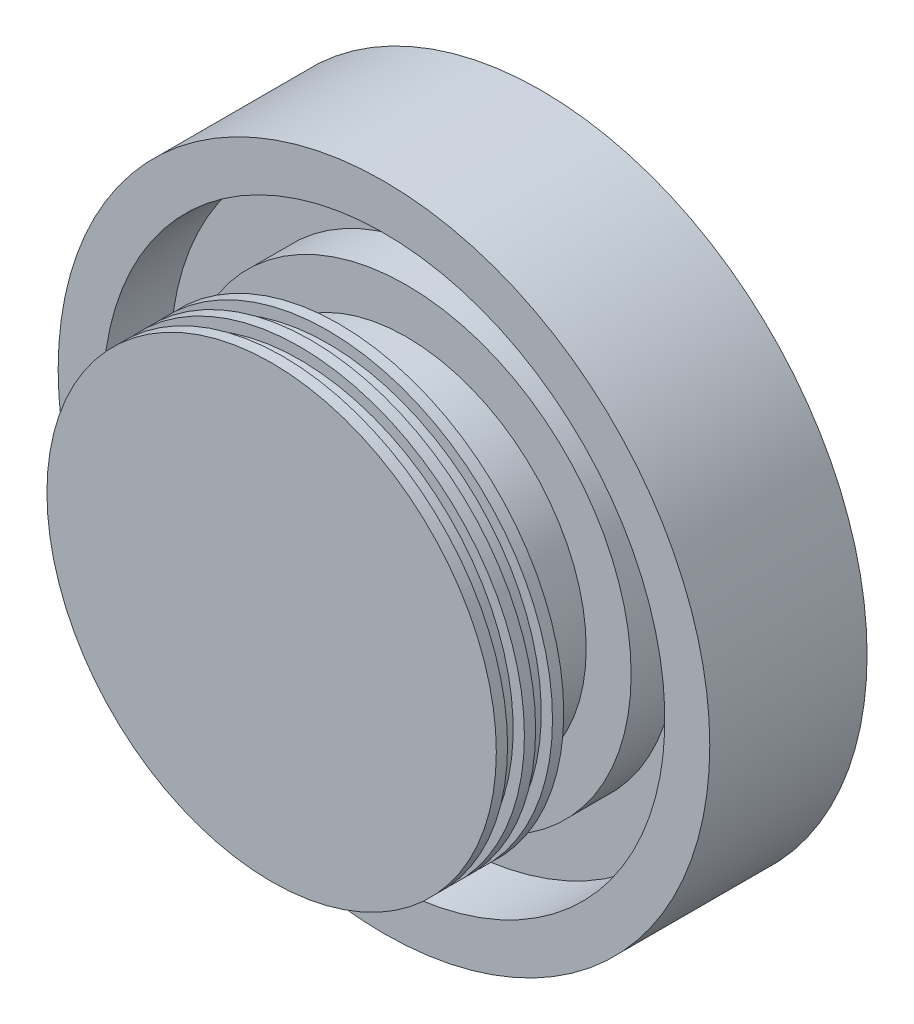
ISO-10303-21;
HEADER;
FILE_DESCRIPTION(('STEP AP214'),'2;1');
FILE_NAME('part.step','',(''),(''),'','','');
FILE_SCHEMA(('AUTOMOTIVE_DESIGN { 1 0 10303 214 1 1 1 1 }'));
ENDSEC;
DATA;
#1=APPLICATION_CONTEXT('core data for automotive mechanical design processes');
#2=APPLICATION_PROTOCOL_DEFINITION('international standard','automotive_design',2000,#1);
#3=PRODUCT_CONTEXT('',#1,'mechanical');
#4=PRODUCT('Part','Part','',(#3));
#5=PRODUCT_RELATED_PRODUCT_CATEGORY('part','',(#4));
#6=PRODUCT_DEFINITION_FORMATION('','',#4);
#7=PRODUCT_DEFINITION_CONTEXT('part definition',#1,'design');
#8=PRODUCT_DEFINITION('design','',#6,#7);
#9=PRODUCT_DEFINITION_SHAPE('','',#8);
#10=(LENGTH_UNIT() NAMED_UNIT(*) SI_UNIT(.MILLI.,.METRE.));
#11=(NAMED_UNIT(*) PLANE_ANGLE_UNIT() SI_UNIT($,.RADIAN.));
#12=(NAMED_UNIT(*) SI_UNIT($,.STERADIAN.) SOLID_ANGLE_UNIT());
#13=UNCERTAINTY_MEASURE_WITH_UNIT(LENGTH_MEASURE(1.E-05),#10,'distance_accuracy_value','');
#14=(GEOMETRIC_REPRESENTATION_CONTEXT(3) GLOBAL_UNCERTAINTY_ASSIGNED_CONTEXT((#13)) GLOBAL_UNIT_ASSIGNED_CONTEXT((#10,
#11,#12)) REPRESENTATION_CONTEXT('',''));
#15=CARTESIAN_POINT('',(0.,0.,0.));
#16=DIRECTION('',(0.,0.,1.));
#17=DIRECTION('',(1.,0.,0.));
#18=AXIS2_PLACEMENT_3D('',#15,#16,#17);
#19=CARTESIAN_POINT('',(0.,0.,-76.2));
#20=DIRECTION('',(0.,0.,-1.));
#21=DIRECTION('',(-1.,0.,0.));
#22=AXIS2_PLACEMENT_3D('',#19,#20,#21);
#23=PLANE('',#22);
#24=CARTESIAN_POINT('',(0.,0.,-76.2));
#25=DIRECTION('',(0.,0.,-1.));
#26=DIRECTION('',(-1.,0.,0.));
#27=AXIS2_PLACEMENT_3D('',#24,#25,#26);
#28=CIRCLE('',#27,92.075);
#29=CARTESIAN_POINT('',(-92.075,0.,-76.2));
#30=VERTEX_POINT('',#29);
#31=EDGE_CURVE('E104',#30,#30,#28,.T.);
#32=ORIENTED_EDGE('',*,*,#31,.T.);
#33=EDGE_LOOP('',(#32));
#34=FACE_BOUND('',#33,.T.);
#35=CARTESIAN_POINT('',(0.,0.,-76.2));
#36=DIRECTION('',(0.,0.,-1.));
#37=DIRECTION('',(-1.,0.,0.));
#38=AXIS2_PLACEMENT_3D('',#35,#36,#37);
#39=CIRCLE('',#38,12.7);
#40=CARTESIAN_POINT('',(-12.7,0.,-76.2));
#41=VERTEX_POINT('',#40);
#42=EDGE_CURVE('E10',#41,#41,#39,.T.);
#43=ORIENTED_EDGE('',*,*,#42,.F.);
#44=EDGE_LOOP('',(#43));
#45=FACE_BOUND('',#44,.T.);
#46=ADVANCED_FACE('F34',(#34,#45),#23,.T.);
#47=CARTESIAN_POINT('',(0.,0.,-44.45));
#48=DIRECTION('',(0.,0.,-1.));
#49=DIRECTION('',(-1.,0.,0.));
#50=AXIS2_PLACEMENT_3D('',#47,#48,#49);
#51=CYLINDRICAL_SURFACE('',#50,12.7);
#52=CARTESIAN_POINT('',(0.,0.,-63.5));
#53=DIRECTION('',(0.,0.,-1.));
#54=DIRECTION('',(-1.,0.,0.));
#55=AXIS2_PLACEMENT_3D('',#52,#53,#54);
#56=CIRCLE('',#55,12.7);
#57=CARTESIAN_POINT('',(-12.7,0.,-63.5));
#58=VERTEX_POINT('',#57);
#59=EDGE_CURVE('E40',#58,#58,#56,.T.);
#60=ORIENTED_EDGE('',*,*,#59,.F.);
#61=EDGE_LOOP('',(#60));
#62=FACE_BOUND('',#61,.T.);
#63=ORIENTED_EDGE('',*,*,#42,.T.);
#64=EDGE_LOOP('',(#63));
#65=FACE_BOUND('',#64,.T.);
#66=ADVANCED_FACE('F223',(#62,#65),#51,.F.);
#67=CARTESIAN_POINT('',(0.,0.,-63.5));
#68=DIRECTION('',(0.,0.,-1.));
#69=DIRECTION('',(-1.,0.,0.));
#70=AXIS2_PLACEMENT_3D('',#67,#68,#69);
#71=PLANE('',#70);
#72=CARTESIAN_POINT('',(0.,0.,-63.5));
#73=DIRECTION('',(0.,0.,-1.));
#74=DIRECTION('',(-1.,0.,0.));
#75=AXIS2_PLACEMENT_3D('',#72,#73,#74);
#76=CIRCLE('',#75,38.1);
#77=CARTESIAN_POINT('',(-38.1,0.,-63.5));
#78=VERTEX_POINT('',#77);
#79=EDGE_CURVE('E44',#78,#78,#76,.T.);
#80=ORIENTED_EDGE('',*,*,#79,.F.);
#81=EDGE_LOOP('',(#80));
#82=FACE_BOUND('',#81,.T.);
#83=ORIENTED_EDGE('',*,*,#59,.T.);
#84=EDGE_LOOP('',(#83));
#85=FACE_BOUND('',#84,.T.);
#86=ADVANCED_FACE('F227',(#82,#85),#71,.F.);
#87=CARTESIAN_POINT('',(0.,0.,-44.45));
#88=DIRECTION('',(0.,0.,-1.));
#89=DIRECTION('',(-1.,0.,0.));
#90=AXIS2_PLACEMENT_3D('',#87,#88,#89);
#91=CYLINDRICAL_SURFACE('',#90,38.1);
#92=CARTESIAN_POINT('',(0.,0.,-44.45));
#93=DIRECTION('',(0.,0.,-1.));
#94=DIRECTION('',(-1.,0.,0.));
#95=AXIS2_PLACEMENT_3D('',#92,#93,#94);
#96=CIRCLE('',#95,38.1);
#97=CARTESIAN_POINT('',(-38.1,0.,-44.45));
#98=VERTEX_POINT('',#97);
#99=EDGE_CURVE('E48',#98,#98,#96,.T.);
#100=ORIENTED_EDGE('',*,*,#99,.F.);
#101=EDGE_LOOP('',(#100));
#102=FACE_BOUND('',#101,.T.);
#103=ORIENTED_EDGE('',*,*,#79,.T.);
#104=EDGE_LOOP('',(#103));
#105=FACE_BOUND('',#104,.T.);
#106=ADVANCED_FACE('F219',(#102,#105),#91,.F.);
#107=CARTESIAN_POINT('',(0.,0.,-44.45));
#108=DIRECTION('',(0.,0.,1.));
#109=DIRECTION('',(1.,0.,0.));
#110=AXIS2_PLACEMENT_3D('',#107,#108,#109);
#111=PLANE('',#110);
#112=ORIENTED_EDGE('',*,*,#99,.T.);
#113=EDGE_LOOP('',(#112));
#114=FACE_BOUND('',#113,.T.);
#115=ADVANCED_FACE('F214',(#114),#111,.F.);
#116=CARTESIAN_POINT('',(0.,0.,0.));
#117=DIRECTION('',(0.,0.,-1.));
#118=DIRECTION('',(-1.,0.,0.));
#119=AXIS2_PLACEMENT_3D('',#116,#117,#118);
#120=PLANE('',#119);
#121=CARTESIAN_POINT('',(0.,0.,0.));
#122=DIRECTION('',(0.,0.,-1.));
#123=DIRECTION('',(-1.,0.,0.));
#124=AXIS2_PLACEMENT_3D('',#121,#122,#123);
#125=CIRCLE('',#124,63.5);
#126=CARTESIAN_POINT('',(-63.5,0.,0.));
#127=VERTEX_POINT('',#126);
#128=EDGE_CURVE('E53',#127,#127,#125,.T.);
#129=ORIENTED_EDGE('',*,*,#128,.F.);
#130=EDGE_LOOP('',(#129));
#131=FACE_BOUND('',#130,.T.);
#132=ADVANCED_FACE('F209',(#131),#120,.F.);
#133=CARTESIAN_POINT('',(0.,0.,-44.45));
#134=DIRECTION('',(0.,0.,-1.));
#135=DIRECTION('',(-1.,0.,0.));
#136=AXIS2_PLACEMENT_3D('',#133,#134,#135);
#137=CYLINDRICAL_SURFACE('',#136,63.5);
#138=CARTESIAN_POINT('',(0.,0.,-3.175));
#139=DIRECTION('',(0.,0.,-1.));
#140=DIRECTION('',(-1.,0.,0.));
#141=AXIS2_PLACEMENT_3D('',#138,#139,#140);
#142=CIRCLE('',#141,63.5);
#143=CARTESIAN_POINT('',(-63.5,0.,-3.17500000000001));
#144=VERTEX_POINT('',#143);
#145=EDGE_CURVE('E56',#144,#144,#142,.T.);
#146=ORIENTED_EDGE('',*,*,#145,.F.);
#147=EDGE_LOOP('',(#146));
#148=FACE_BOUND('',#147,.T.);
#149=ORIENTED_EDGE('',*,*,#128,.T.);
#150=EDGE_LOOP('',(#149));
#151=FACE_BOUND('',#150,.T.);
#152=ADVANCED_FACE('F203',(#148,#151),#137,.T.);
#153=CARTESIAN_POINT('',(0.,0.,-3.17500000000001));
#154=DIRECTION('',(0.,0.,1.));
#155=DIRECTION('',(1.,0.,0.));
#156=AXIS2_PLACEMENT_3D('',#153,#154,#155);
#157=PLANE('',#156);
#158=CARTESIAN_POINT('',(0.,0.,-3.175));
#159=DIRECTION('',(0.,0.,-1.));
#160=DIRECTION('',(-1.,0.,0.));
#161=AXIS2_PLACEMENT_3D('',#158,#159,#160);
#162=CIRCLE('',#161,60.325);
#163=CARTESIAN_POINT('',(-60.325,0.,-3.17500000000001));
#164=VERTEX_POINT('',#163);
#165=EDGE_CURVE('E59',#164,#164,#162,.T.);
#166=ORIENTED_EDGE('',*,*,#165,.F.);
#167=EDGE_LOOP('',(#166));
#168=FACE_BOUND('',#167,.T.);
#169=ORIENTED_EDGE('',*,*,#145,.T.);
#170=EDGE_LOOP('',(#169));
#171=FACE_BOUND('',#170,.T.);
#172=ADVANCED_FACE('F197',(#168,#171),#157,.F.);
#173=CARTESIAN_POINT('',(0.,0.,-44.45));
#174=DIRECTION('',(0.,0.,-1.));
#175=DIRECTION('',(-1.,0.,0.));
#176=AXIS2_PLACEMENT_3D('',#173,#174,#175);
#177=CYLINDRICAL_SURFACE('',#176,60.325);
#178=CARTESIAN_POINT('',(0.,0.,-7.9375));
#179=DIRECTION('',(0.,0.,-1.));
#180=DIRECTION('',(-1.,0.,0.));
#181=AXIS2_PLACEMENT_3D('',#178,#179,#180);
#182=CIRCLE('',#181,60.325);
#183=CARTESIAN_POINT('',(-60.325,0.,-7.93750000000001));
#184=VERTEX_POINT('',#183);
#185=EDGE_CURVE('E62',#184,#184,#182,.T.);
#186=ORIENTED_EDGE('',*,*,#185,.F.);
#187=EDGE_LOOP('',(#186));
#188=FACE_BOUND('',#187,.T.);
#189=ORIENTED_EDGE('',*,*,#165,.T.);
#190=EDGE_LOOP('',(#189));
#191=FACE_BOUND('',#190,.T.);
#192=ADVANCED_FACE('F191',(#188,#191),#177,.T.);
#193=CARTESIAN_POINT('',(0.,0.,-7.9375));
#194=DIRECTION('',(0.,0.,-1.));
#195=DIRECTION('',(-1.,0.,0.));
#196=AXIS2_PLACEMENT_3D('',#193,#194,#195);
#197=PLANE('',#196);
#198=CARTESIAN_POINT('',(0.,0.,-7.93750000000001));
#199=DIRECTION('',(0.,0.,-1.));
#200=DIRECTION('',(-1.,0.,0.));
#201=AXIS2_PLACEMENT_3D('',#198,#199,#200);
#202=CIRCLE('',#201,63.5);
#203=CARTESIAN_POINT('',(-63.5,0.,-7.93750000000001));
#204=VERTEX_POINT('',#203);
#205=EDGE_CURVE('E65',#204,#204,#202,.T.);
#206=ORIENTED_EDGE('',*,*,#205,.F.);
#207=EDGE_LOOP('',(#206));
#208=FACE_BOUND('',#207,.T.);
#209=ORIENTED_EDGE('',*,*,#185,.T.);
#210=EDGE_LOOP('',(#209));
#211=FACE_BOUND('',#210,.T.);
#212=ADVANCED_FACE('F185',(#208,#211),#197,.F.);
#213=CARTESIAN_POINT('',(0.,0.,-44.45));
#214=DIRECTION('',(0.,0.,-1.));
#215=DIRECTION('',(-1.,0.,0.));
#216=AXIS2_PLACEMENT_3D('',#213,#214,#215);
#217=CYLINDRICAL_SURFACE('',#216,63.5);
#218=CARTESIAN_POINT('',(0.,0.,-11.1125));
#219=DIRECTION('',(0.,0.,-1.));
#220=DIRECTION('',(-1.,0.,0.));
#221=AXIS2_PLACEMENT_3D('',#218,#219,#220);
#222=CIRCLE('',#221,63.5);
#223=CARTESIAN_POINT('',(-63.5,0.,-11.1125));
#224=VERTEX_POINT('',#223);
#225=EDGE_CURVE('E68',#224,#224,#222,.T.);
#226=ORIENTED_EDGE('',*,*,#225,.F.);
#227=EDGE_LOOP('',(#226));
#228=FACE_BOUND('',#227,.T.);
#229=ORIENTED_EDGE('',*,*,#205,.T.);
#230=EDGE_LOOP('',(#229));
#231=FACE_BOUND('',#230,.T.);
#232=ADVANCED_FACE('F179',(#228,#231),#217,.T.);
#233=CARTESIAN_POINT('',(0.,0.,-11.1125));
#234=DIRECTION('',(0.,0.,1.));
#235=DIRECTION('',(1.,0.,0.));
#236=AXIS2_PLACEMENT_3D('',#233,#234,#235);
#237=PLANE('',#236);
#238=CARTESIAN_POINT('',(0.,0.,-11.1125));
#239=DIRECTION('',(0.,0.,-1.));
#240=DIRECTION('',(-1.,0.,0.));
#241=AXIS2_PLACEMENT_3D('',#238,#239,#240);
#242=CIRCLE('',#241,60.325);
#243=CARTESIAN_POINT('',(-60.325,0.,-11.1125));
#244=VERTEX_POINT('',#243);
#245=EDGE_CURVE('E71',#244,#244,#242,.T.);
#246=ORIENTED_EDGE('',*,*,#245,.F.);
#247=EDGE_LOOP('',(#246));
#248=FACE_BOUND('',#247,.T.);
#249=ORIENTED_EDGE('',*,*,#225,.T.);
#250=EDGE_LOOP('',(#249));
#251=FACE_BOUND('',#250,.T.);
#252=ADVANCED_FACE('F173',(#248,#251),#237,.F.);
#253=CARTESIAN_POINT('',(0.,0.,-44.45));
#254=DIRECTION('',(0.,0.,-1.));
#255=DIRECTION('',(-1.,0.,0.));
#256=AXIS2_PLACEMENT_3D('',#253,#254,#255);
#257=CYLINDRICAL_SURFACE('',#256,60.325);
#258=CARTESIAN_POINT('',(0.,0.,-15.875));
#259=DIRECTION('',(0.,0.,-1.));
#260=DIRECTION('',(-1.,0.,0.));
#261=AXIS2_PLACEMENT_3D('',#258,#259,#260);
#262=CIRCLE('',#261,60.325);
#263=CARTESIAN_POINT('',(-60.325,0.,-15.875));
#264=VERTEX_POINT('',#263);
#265=EDGE_CURVE('E74',#264,#264,#262,.T.);
#266=ORIENTED_EDGE('',*,*,#265,.F.);
#267=EDGE_LOOP('',(#266));
#268=FACE_BOUND('',#267,.T.);
#269=ORIENTED_EDGE('',*,*,#245,.T.);
#270=EDGE_LOOP('',(#269));
#271=FACE_BOUND('',#270,.T.);
#272=ADVANCED_FACE('F167',(#268,#271),#257,.T.);
#273=CARTESIAN_POINT('',(0.,0.,-15.875));
#274=DIRECTION('',(0.,0.,-1.));
#275=DIRECTION('',(-1.,0.,0.));
#276=AXIS2_PLACEMENT_3D('',#273,#274,#275);
#277=PLANE('',#276);
#278=CARTESIAN_POINT('',(0.,0.,-15.875));
#279=DIRECTION('',(0.,0.,-1.));
#280=DIRECTION('',(-1.,0.,0.));
#281=AXIS2_PLACEMENT_3D('',#278,#279,#280);
#282=CIRCLE('',#281,63.5);
#283=CARTESIAN_POINT('',(-63.5,0.,-15.875));
#284=VERTEX_POINT('',#283);
#285=EDGE_CURVE('E77',#284,#284,#282,.T.);
#286=ORIENTED_EDGE('',*,*,#285,.F.);
#287=EDGE_LOOP('',(#286));
#288=FACE_BOUND('',#287,.T.);
#289=ORIENTED_EDGE('',*,*,#265,.T.);
#290=EDGE_LOOP('',(#289));
#291=FACE_BOUND('',#290,.T.);
#292=ADVANCED_FACE('F161',(#288,#291),#277,.F.);
#293=CARTESIAN_POINT('',(0.,0.,-44.45));
#294=DIRECTION('',(0.,0.,-1.));
#295=DIRECTION('',(-1.,0.,0.));
#296=AXIS2_PLACEMENT_3D('',#293,#294,#295);
#297=CYLINDRICAL_SURFACE('',#296,63.5);
#298=CARTESIAN_POINT('',(0.,0.,-19.05));
#299=DIRECTION('',(0.,0.,-1.));
#300=DIRECTION('',(-1.,0.,0.));
#301=AXIS2_PLACEMENT_3D('',#298,#299,#300);
#302=CIRCLE('',#301,63.5);
#303=CARTESIAN_POINT('',(-63.5,0.,-19.05));
#304=VERTEX_POINT('',#303);
#305=EDGE_CURVE('E80',#304,#304,#302,.T.);
#306=ORIENTED_EDGE('',*,*,#305,.F.);
#307=EDGE_LOOP('',(#306));
#308=FACE_BOUND('',#307,.T.);
#309=ORIENTED_EDGE('',*,*,#285,.T.);
#310=EDGE_LOOP('',(#309));
#311=FACE_BOUND('',#310,.T.);
#312=ADVANCED_FACE('F155',(#308,#311),#297,.T.);
#313=CARTESIAN_POINT('',(0.,0.,-19.05));
#314=DIRECTION('',(0.,0.,1.));
#315=DIRECTION('',(1.,0.,0.));
#316=AXIS2_PLACEMENT_3D('',#313,#314,#315);
#317=PLANE('',#316);
#318=CARTESIAN_POINT('',(0.,0.,-19.05));
#319=DIRECTION('',(0.,0.,-1.));
#320=DIRECTION('',(-1.,0.,0.));
#321=AXIS2_PLACEMENT_3D('',#318,#319,#320);
#322=CIRCLE('',#321,50.8);
#323=CARTESIAN_POINT('',(-50.8,0.,-19.05));
#324=VERTEX_POINT('',#323);
#325=EDGE_CURVE('E83',#324,#324,#322,.T.);
#326=ORIENTED_EDGE('',*,*,#325,.F.);
#327=EDGE_LOOP('',(#326));
#328=FACE_BOUND('',#327,.T.);
#329=ORIENTED_EDGE('',*,*,#305,.T.);
#330=EDGE_LOOP('',(#329));
#331=FACE_BOUND('',#330,.T.);
#332=ADVANCED_FACE('F149',(#328,#331),#317,.F.);
#333=CARTESIAN_POINT('',(0.,0.,-44.45));
#334=DIRECTION('',(0.,0.,-1.));
#335=DIRECTION('',(-1.,0.,0.));
#336=AXIS2_PLACEMENT_3D('',#333,#334,#335);
#337=CYLINDRICAL_SURFACE('',#336,50.8);
#338=CARTESIAN_POINT('',(0.,0.,-38.1));
#339=DIRECTION('',(0.,0.,-1.));
#340=DIRECTION('',(-1.,0.,0.));
#341=AXIS2_PLACEMENT_3D('',#338,#339,#340);
#342=CIRCLE('',#341,50.8);
#343=CARTESIAN_POINT('',(-50.8,0.,-38.1));
#344=VERTEX_POINT('',#343);
#345=EDGE_CURVE('E86',#344,#344,#342,.T.);
#346=ORIENTED_EDGE('',*,*,#345,.F.);
#347=EDGE_LOOP('',(#346));
#348=FACE_BOUND('',#347,.T.);
#349=ORIENTED_EDGE('',*,*,#325,.T.);
#350=EDGE_LOOP('',(#349));
#351=FACE_BOUND('',#350,.T.);
#352=ADVANCED_FACE('F143',(#348,#351),#337,.T.);
#353=CARTESIAN_POINT('',(0.,0.,-38.1));
#354=DIRECTION('',(0.,0.,-1.));
#355=DIRECTION('',(-1.,0.,0.));
#356=AXIS2_PLACEMENT_3D('',#353,#354,#355);
#357=PLANE('',#356);
#358=CARTESIAN_POINT('',(0.,0.,-38.1));
#359=DIRECTION('',(0.,0.,-1.));
#360=DIRECTION('',(-1.,0.,0.));
#361=AXIS2_PLACEMENT_3D('',#358,#359,#360);
#362=CIRCLE('',#361,63.5);
#363=CARTESIAN_POINT('',(-63.5,0.,-38.1));
#364=VERTEX_POINT('',#363);
#365=EDGE_CURVE('E89',#364,#364,#362,.T.);
#366=ORIENTED_EDGE('',*,*,#365,.F.);
#367=EDGE_LOOP('',(#366));
#368=FACE_BOUND('',#367,.T.);
#369=ORIENTED_EDGE('',*,*,#345,.T.);
#370=EDGE_LOOP('',(#369));
#371=FACE_BOUND('',#370,.T.);
#372=ADVANCED_FACE('F137',(#368,#371),#357,.F.);
#373=CARTESIAN_POINT('',(0.,0.,-44.45));
#374=DIRECTION('',(0.,0.,-1.));
#375=DIRECTION('',(-1.,0.,0.));
#376=AXIS2_PLACEMENT_3D('',#373,#374,#375);
#377=CYLINDRICAL_SURFACE('',#376,63.5);
#378=CARTESIAN_POINT('',(0.,0.,-50.8));
#379=DIRECTION('',(0.,0.,-1.));
#380=DIRECTION('',(-1.,0.,0.));
#381=AXIS2_PLACEMENT_3D('',#378,#379,#380);
#382=CIRCLE('',#381,63.5);
#383=CARTESIAN_POINT('',(-63.5,0.,-50.8));
#384=VERTEX_POINT('',#383);
#385=EDGE_CURVE('E92',#384,#384,#382,.T.);
#386=ORIENTED_EDGE('',*,*,#385,.F.);
#387=EDGE_LOOP('',(#386));
#388=FACE_BOUND('',#387,.T.);
#389=ORIENTED_EDGE('',*,*,#365,.T.);
#390=EDGE_LOOP('',(#389));
#391=FACE_BOUND('',#390,.T.);
#392=ADVANCED_FACE('F131',(#388,#391),#377,.T.);
#393=CARTESIAN_POINT('',(0.,0.,-50.8));
#394=DIRECTION('',(0.,0.,-1.));
#395=DIRECTION('',(-1.,0.,0.));
#396=AXIS2_PLACEMENT_3D('',#393,#394,#395);
#397=PLANE('',#396);
#398=CARTESIAN_POINT('',(0.,0.,-50.8));
#399=DIRECTION('',(0.,0.,-1.));
#400=DIRECTION('',(-1.,0.,0.));
#401=AXIS2_PLACEMENT_3D('',#398,#399,#400);
#402=CIRCLE('',#401,79.375);
#403=CARTESIAN_POINT('',(-79.375,0.,-50.8));
#404=VERTEX_POINT('',#403);
#405=EDGE_CURVE('E95',#404,#404,#402,.T.);
#406=ORIENTED_EDGE('',*,*,#405,.F.);
#407=EDGE_LOOP('',(#406));
#408=FACE_BOUND('',#407,.T.);
#409=ORIENTED_EDGE('',*,*,#385,.T.);
#410=EDGE_LOOP('',(#409));
#411=FACE_BOUND('',#410,.T.);
#412=ADVANCED_FACE('F125',(#408,#411),#397,.F.);
#413=CARTESIAN_POINT('',(0.,0.,-44.45));
#414=DIRECTION('',(0.,0.,-1.));
#415=DIRECTION('',(-1.,0.,0.));
#416=AXIS2_PLACEMENT_3D('',#413,#414,#415);
#417=CYLINDRICAL_SURFACE('',#416,79.375);
#418=CARTESIAN_POINT('',(0.,0.,-31.75));
#419=DIRECTION('',(0.,0.,-1.));
#420=DIRECTION('',(-1.,0.,0.));
#421=AXIS2_PLACEMENT_3D('',#418,#419,#420);
#422=CIRCLE('',#421,79.375);
#423=CARTESIAN_POINT('',(-79.375,0.,-31.75));
#424=VERTEX_POINT('',#423);
#425=EDGE_CURVE('E98',#424,#424,#422,.T.);
#426=ORIENTED_EDGE('',*,*,#425,.F.);
#427=EDGE_LOOP('',(#426));
#428=FACE_BOUND('',#427,.T.);
#429=ORIENTED_EDGE('',*,*,#405,.T.);
#430=EDGE_LOOP('',(#429));
#431=FACE_BOUND('',#430,.T.);
#432=ADVANCED_FACE('F119',(#428,#431),#417,.F.);
#433=CARTESIAN_POINT('',(0.,0.,-31.75));
#434=DIRECTION('',(0.,0.,-1.));
#435=DIRECTION('',(-1.,0.,0.));
#436=AXIS2_PLACEMENT_3D('',#433,#434,#435);
#437=PLANE('',#436);
#438=CARTESIAN_POINT('',(0.,0.,-31.75));
#439=DIRECTION('',(0.,0.,-1.));
#440=DIRECTION('',(-1.,0.,0.));
#441=AXIS2_PLACEMENT_3D('',#438,#439,#440);
#442=CIRCLE('',#441,92.075);
#443=CARTESIAN_POINT('',(-92.075,0.,-31.75));
#444=VERTEX_POINT('',#443);
#445=EDGE_CURVE('E101',#444,#444,#442,.T.);
#446=ORIENTED_EDGE('',*,*,#445,.F.);
#447=EDGE_LOOP('',(#446));
#448=FACE_BOUND('',#447,.T.);
#449=ORIENTED_EDGE('',*,*,#425,.T.);
#450=EDGE_LOOP('',(#449));
#451=FACE_BOUND('',#450,.T.);
#452=ADVANCED_FACE('F113',(#448,#451),#437,.F.);
#453=CARTESIAN_POINT('',(0.,0.,-44.45));
#454=DIRECTION('',(0.,0.,-1.));
#455=DIRECTION('',(-1.,0.,0.));
#456=AXIS2_PLACEMENT_3D('',#453,#454,#455);
#457=CYLINDRICAL_SURFACE('',#456,92.075);
#458=ORIENTED_EDGE('',*,*,#31,.F.);
#459=EDGE_LOOP('',(#458));
#460=FACE_BOUND('',#459,.T.);
#461=ORIENTED_EDGE('',*,*,#445,.T.);
#462=EDGE_LOOP('',(#461));
#463=FACE_BOUND('',#462,.T.);
#464=ADVANCED_FACE('F110',(#460,#463),#457,.T.);
#465=CLOSED_SHELL('',(#46,#66,#86,#106,#115,#132,#152,#172,#192,#212,#232,#252,#272,#292,#312,
#332,#352,#372,#392,#412,#432,#452,#464));
#466=MANIFOLD_SOLID_BREP('B2',#465);
#467=ADVANCED_BREP_SHAPE_REPRESENTATION('',(#18,#466),#14);
#468=SHAPE_DEFINITION_REPRESENTATION(#9,#467);
ENDSEC;
END-ISO-10303-21;
